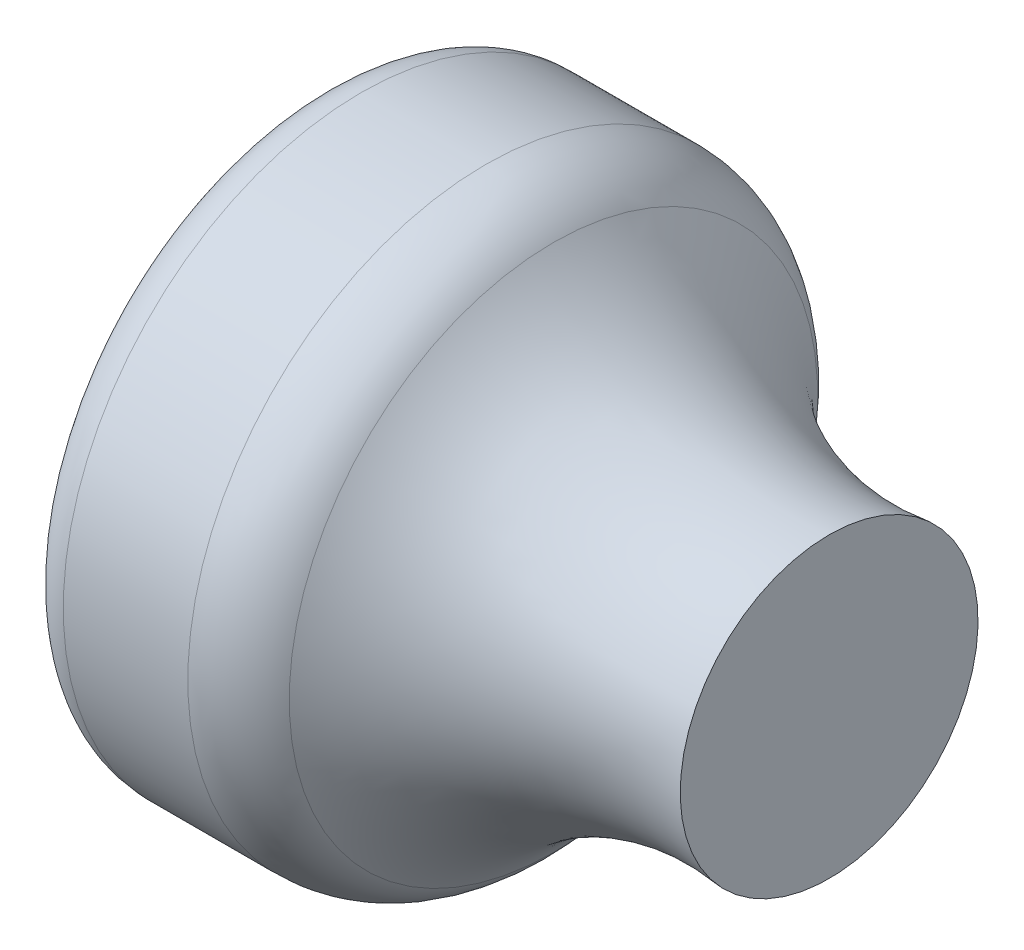
ISO-10303-21;
HEADER;
FILE_DESCRIPTION(('STEP AP214'),'2;1');
FILE_NAME('part.step','',(''),(''),'','','');
FILE_SCHEMA(('AUTOMOTIVE_DESIGN { 1 0 10303 214 1 1 1 1 }'));
ENDSEC;
DATA;
#1=APPLICATION_CONTEXT('core data for automotive mechanical design processes');
#2=APPLICATION_PROTOCOL_DEFINITION('international standard','automotive_design',2000,#1);
#3=PRODUCT_CONTEXT('',#1,'mechanical');
#4=PRODUCT('Part','Part','',(#3));
#5=PRODUCT_RELATED_PRODUCT_CATEGORY('part','',(#4));
#6=PRODUCT_DEFINITION_FORMATION('','',#4);
#7=PRODUCT_DEFINITION_CONTEXT('part definition',#1,'design');
#8=PRODUCT_DEFINITION('design','',#6,#7);
#9=PRODUCT_DEFINITION_SHAPE('','',#8);
#10=(LENGTH_UNIT() NAMED_UNIT(*) SI_UNIT(.MILLI.,.METRE.));
#11=(NAMED_UNIT(*) PLANE_ANGLE_UNIT() SI_UNIT($,.RADIAN.));
#12=(NAMED_UNIT(*) SI_UNIT($,.STERADIAN.) SOLID_ANGLE_UNIT());
#13=UNCERTAINTY_MEASURE_WITH_UNIT(LENGTH_MEASURE(1.E-05),#10,'distance_accuracy_value','');
#14=(GEOMETRIC_REPRESENTATION_CONTEXT(3) GLOBAL_UNCERTAINTY_ASSIGNED_CONTEXT((#13)) GLOBAL_UNIT_ASSIGNED_CONTEXT((#10,
#11,#12)) REPRESENTATION_CONTEXT('',''));
#15=CARTESIAN_POINT('',(0.,0.,0.));
#16=DIRECTION('',(0.,0.,1.));
#17=DIRECTION('',(1.,0.,0.));
#18=AXIS2_PLACEMENT_3D('',#15,#16,#17);
#19=CARTESIAN_POINT('',(-12.,0.,0.));
#20=DIRECTION('',(-1.,0.,0.));
#21=DIRECTION('',(0.,-1.,0.));
#22=AXIS2_PLACEMENT_3D('',#19,#20,#21);
#23=PLANE('',#22);
#24=CARTESIAN_POINT('',(-12.,0.,0.));
#25=DIRECTION('',(1.,0.,0.));
#26=DIRECTION('',(0.,1.,0.));
#27=AXIS2_PLACEMENT_3D('',#24,#25,#26);
#28=CIRCLE('',#27,6.);
#29=CARTESIAN_POINT('',(-12.,6.,0.));
#30=VERTEX_POINT('',#29);
#31=EDGE_CURVE('E10',#30,#30,#28,.T.);
#32=ORIENTED_EDGE('',*,*,#31,.F.);
#33=EDGE_LOOP('',(#32));
#34=FACE_BOUND('',#33,.T.);
#35=ADVANCED_FACE('F31',(#34),#23,.T.);
#36=CARTESIAN_POINT('',(-11.,0.,0.));
#37=DIRECTION('',(1.,0.,0.));
#38=DIRECTION('',(0.,1.,0.));
#39=AXIS2_PLACEMENT_3D('',#36,#37,#38);
#40=TOROIDAL_SURFACE('',#39,6.,1.);
#41=ORIENTED_EDGE('',*,*,#31,.T.);
#42=EDGE_LOOP('',(#41));
#43=FACE_BOUND('',#42,.T.);
#44=CARTESIAN_POINT('',(-11.,0.,0.));
#45=DIRECTION('',(1.,0.,0.));
#46=DIRECTION('',(0.,1.,0.));
#47=AXIS2_PLACEMENT_3D('',#44,#45,#46);
#48=CIRCLE('',#47,7.);
#49=CARTESIAN_POINT('',(-11.,7.,0.));
#50=VERTEX_POINT('',#49);
#51=EDGE_CURVE('E37',#50,#50,#48,.T.);
#52=ORIENTED_EDGE('',*,*,#51,.F.);
#53=EDGE_LOOP('',(#52));
#54=FACE_BOUND('',#53,.T.);
#55=ADVANCED_FACE('F70',(#43,#54),#40,.T.);
#56=CARTESIAN_POINT('',(0.,0.,0.));
#57=DIRECTION('',(1.,0.,0.));
#58=DIRECTION('',(0.,1.,0.));
#59=AXIS2_PLACEMENT_3D('',#56,#57,#58);
#60=CYLINDRICAL_SURFACE('',#59,7.);
#61=ORIENTED_EDGE('',*,*,#51,.T.);
#62=EDGE_LOOP('',(#61));
#63=FACE_BOUND('',#62,.T.);
#64=CARTESIAN_POINT('',(-8.07314009104879,0.,0.));
#65=DIRECTION('',(1.,0.,0.));
#66=DIRECTION('',(0.,1.,0.));
#67=AXIS2_PLACEMENT_3D('',#64,#65,#66);
#68=CIRCLE('',#67,7.);
#69=CARTESIAN_POINT('',(-8.07314009104879,7.,0.));
#70=VERTEX_POINT('',#69);
#71=EDGE_CURVE('E41',#70,#70,#68,.T.);
#72=ORIENTED_EDGE('',*,*,#71,.F.);
#73=EDGE_LOOP('',(#72));
#74=FACE_BOUND('',#73,.T.);
#75=ADVANCED_FACE('F66',(#63,#74),#60,.T.);
#76=CARTESIAN_POINT('',(-8.07314009104879,0.,0.));
#77=DIRECTION('',(1.,0.,0.));
#78=DIRECTION('',(0.,1.,0.));
#79=AXIS2_PLACEMENT_3D('',#76,#77,#78);
#80=TOROIDAL_SURFACE('',#79,5.,2.);
#81=ORIENTED_EDGE('',*,*,#71,.T.);
#82=EDGE_LOOP('',(#81));
#83=FACE_BOUND('',#82,.T.);
#84=CARTESIAN_POINT('',(-6.48007129959717,0.,0.));
#85=DIRECTION('',(1.,0.,0.));
#86=DIRECTION('',(0.,1.,0.));
#87=AXIS2_PLACEMENT_3D('',#84,#85,#86);
#88=CIRCLE('',#87,6.20918643132599);
#89=CARTESIAN_POINT('',(-6.48007129959717,6.20918643132599,0.));
#90=VERTEX_POINT('',#89);
#91=EDGE_CURVE('E45',#90,#90,#88,.T.);
#92=ORIENTED_EDGE('',*,*,#91,.F.);
#93=EDGE_LOOP('',(#92));
#94=FACE_BOUND('',#93,.T.);
#95=ADVANCED_FACE('F58',(#83,#94),#80,.T.);
#96=CARTESIAN_POINT('',(-0.904330529516518,0.,0.));
#97=DIRECTION('',(1.,0.,0.));
#98=DIRECTION('',(0.,1.,0.));
#99=AXIS2_PLACEMENT_3D('',#96,#97,#98);
#100=TOROIDAL_SURFACE('',#99,10.441338940967,7.);
#101=ORIENTED_EDGE('',*,*,#91,.T.);
#102=EDGE_LOOP('',(#101));
#103=FACE_BOUND('',#102,.T.);
#104=CARTESIAN_POINT('',(0.,0.,0.));
#105=DIRECTION('',(1.,0.,0.));
#106=DIRECTION('',(0.,1.,0.));
#107=AXIS2_PLACEMENT_3D('',#104,#105,#106);
#108=CIRCLE('',#107,3.5);
#109=CARTESIAN_POINT('',(0.,3.5,0.));
#110=VERTEX_POINT('',#109);
#111=EDGE_CURVE('E50',#110,#110,#108,.T.);
#112=ORIENTED_EDGE('',*,*,#111,.F.);
#113=EDGE_LOOP('',(#112));
#114=FACE_BOUND('',#113,.T.);
#115=ADVANCED_FACE('F56',(#103,#114),#100,.F.);
#116=CARTESIAN_POINT('',(0.,3.5,0.));
#117=DIRECTION('',(1.,0.,0.));
#118=DIRECTION('',(0.,1.,0.));
#119=AXIS2_PLACEMENT_3D('',#116,#117,#118);
#120=PLANE('',#119);
#121=ORIENTED_EDGE('',*,*,#111,.T.);
#122=EDGE_LOOP('',(#121));
#123=FACE_BOUND('',#122,.T.);
#124=ADVANCED_FACE('F54',(#123),#120,.T.);
#125=CLOSED_SHELL('',(#35,#55,#75,#95,#115,#124));
#126=MANIFOLD_SOLID_BREP('B2',#125);
#127=ADVANCED_BREP_SHAPE_REPRESENTATION('',(#18,#126),#14);
#128=SHAPE_DEFINITION_REPRESENTATION(#9,#127);
ENDSEC;
END-ISO-10303-21;
